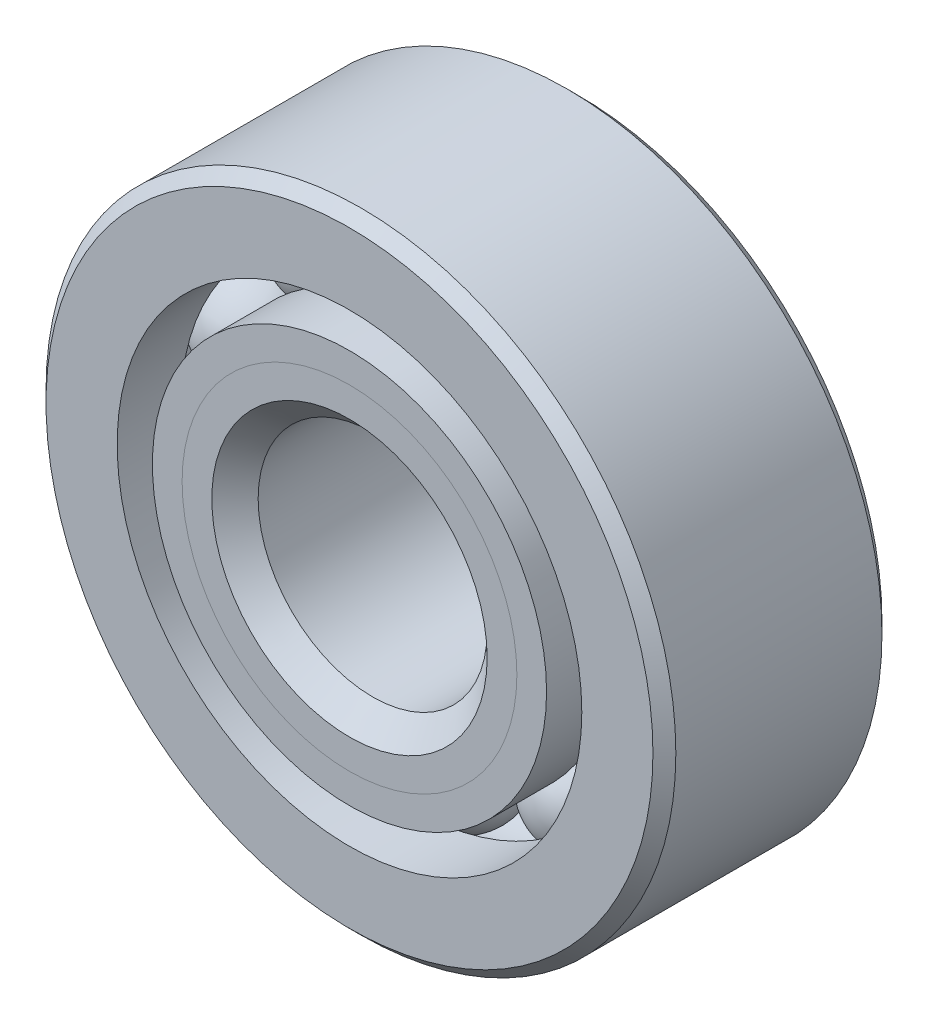
ISO-10303-21;
HEADER;
FILE_DESCRIPTION(('STEP AP214'),'2;1');
FILE_NAME('part.step','',(''),(''),'','','');
FILE_SCHEMA(('AUTOMOTIVE_DESIGN { 1 0 10303 214 1 1 1 1 }'));
ENDSEC;
DATA;
#1=APPLICATION_CONTEXT('core data for automotive mechanical design processes');
#2=APPLICATION_PROTOCOL_DEFINITION('international standard','automotive_design',2000,#1);
#3=PRODUCT_CONTEXT('',#1,'mechanical');
#4=PRODUCT('Part','Part','',(#3));
#5=PRODUCT_RELATED_PRODUCT_CATEGORY('part','',(#4));
#6=PRODUCT_DEFINITION_FORMATION('','',#4);
#7=PRODUCT_DEFINITION_CONTEXT('part definition',#1,'design');
#8=PRODUCT_DEFINITION('design','',#6,#7);
#9=PRODUCT_DEFINITION_SHAPE('','',#8);
#10=(LENGTH_UNIT() NAMED_UNIT(*) SI_UNIT(.MILLI.,.METRE.));
#11=(NAMED_UNIT(*) PLANE_ANGLE_UNIT() SI_UNIT($,.RADIAN.));
#12=(NAMED_UNIT(*) SI_UNIT($,.STERADIAN.) SOLID_ANGLE_UNIT());
#13=UNCERTAINTY_MEASURE_WITH_UNIT(LENGTH_MEASURE(1.E-05),#10,'distance_accuracy_value','');
#14=(GEOMETRIC_REPRESENTATION_CONTEXT(3) GLOBAL_UNCERTAINTY_ASSIGNED_CONTEXT((#13)) GLOBAL_UNIT_ASSIGNED_CONTEXT((#10,
#11,#12)) REPRESENTATION_CONTEXT('',''));
#15=CARTESIAN_POINT('',(0.,0.,0.));
#16=DIRECTION('',(0.,0.,1.));
#17=DIRECTION('',(1.,0.,0.));
#18=AXIS2_PLACEMENT_3D('',#15,#16,#17);
#19=CARTESIAN_POINT('',(-3.49915908005357,4.81617929463841,0.));
#20=DIRECTION('',(0.,0.,1.));
#21=DIRECTION('',(-0.587785252292462,0.809016994374955,0.));
#22=AXIS2_PLACEMENT_3D('',#19,#20,#21);
#23=SPHERICAL_SURFACE('',#22,1.4932612773582);
#24=CARTESIAN_POINT('',(-3.49915908005357,4.81617929463841,1.4932612773582));
#25=VERTEX_POINT('',#24);
#26=VERTEX_LOOP('',#25);
#27=FACE_BOUND('',#26,.T.);
#28=ADVANCED_FACE('F43',(#27),#23,.T.);
#29=CLOSED_SHELL('',(#28));
#30=MANIFOLD_SOLID_BREP('B2',#29);
#31=CARTESIAN_POINT('',(-5.66175832356957,1.83961679463842,0.));
#32=DIRECTION('',(0.,0.,1.));
#33=DIRECTION('',(-0.95105651629515,0.309016994374958,0.));
#34=AXIS2_PLACEMENT_3D('',#31,#32,#33);
#35=SPHERICAL_SURFACE('',#34,1.4932612773582);
#36=CARTESIAN_POINT('',(-5.66175832356957,1.83961679463842,1.4932612773582));
#37=VERTEX_POINT('',#36);
#38=VERTEX_LOOP('',#37);
#39=FACE_BOUND('',#38,.T.);
#40=ADVANCED_FACE('F64',(#39),#35,.T.);
#41=CLOSED_SHELL('',(#40));
#42=MANIFOLD_SOLID_BREP('B6',#41);
#43=CARTESIAN_POINT('',(-5.6617583235696,-1.8396167946383,0.));
#44=DIRECTION('',(0.,0.,1.));
#45=DIRECTION('',(-0.951056516295157,-0.309016994374938,0.));
#46=AXIS2_PLACEMENT_3D('',#43,#44,#45);
#47=SPHERICAL_SURFACE('',#46,1.4932612773582);
#48=CARTESIAN_POINT('',(-5.6617583235696,-1.8396167946383,1.4932612773582));
#49=VERTEX_POINT('',#48);
#50=VERTEX_LOOP('',#49);
#51=FACE_BOUND('',#50,.T.);
#52=ADVANCED_FACE('F85',(#51),#47,.T.);
#53=CLOSED_SHELL('',(#52));
#54=MANIFOLD_SOLID_BREP('B39',#53);
#55=CARTESIAN_POINT('',(-3.49915908005367,-4.81617929463833,0.));
#56=DIRECTION('',(0.,0.,1.));
#57=DIRECTION('',(-0.58778525229248,-0.809016994374942,0.));
#58=AXIS2_PLACEMENT_3D('',#55,#56,#57);
#59=SPHERICAL_SURFACE('',#58,1.4932612773582);
#60=CARTESIAN_POINT('',(-3.49915908005367,-4.81617929463833,1.4932612773582));
#61=VERTEX_POINT('',#60);
#62=VERTEX_LOOP('',#61);
#63=FACE_BOUND('',#62,.T.);
#64=ADVANCED_FACE('F106',(#63),#59,.T.);
#65=CLOSED_SHELL('',(#64));
#66=MANIFOLD_SOLID_BREP('B60',#65);
#67=CARTESIAN_POINT('',(0.,-5.953125,0.));
#68=DIRECTION('',(0.,0.,1.));
#69=DIRECTION('',(0.,-1.,0.));
#70=AXIS2_PLACEMENT_3D('',#67,#68,#69);
#71=SPHERICAL_SURFACE('',#70,1.4932612773582);
#72=CARTESIAN_POINT('',(0.,-5.953125,1.4932612773582));
#73=VERTEX_POINT('',#72);
#74=VERTEX_LOOP('',#73);
#75=FACE_BOUND('',#74,.T.);
#76=ADVANCED_FACE('F127',(#75),#71,.T.);
#77=CLOSED_SHELL('',(#76));
#78=MANIFOLD_SOLID_BREP('B81',#77);
#79=CARTESIAN_POINT('',(3.4991590800536,-4.81617929463838,0.));
#80=DIRECTION('',(0.,0.,1.));
#81=DIRECTION('',(0.587785252292469,-0.809016994374951,0.));
#82=AXIS2_PLACEMENT_3D('',#79,#80,#81);
#83=SPHERICAL_SURFACE('',#82,1.4932612773582);
#84=CARTESIAN_POINT('',(3.4991590800536,-4.81617929463838,1.4932612773582));
#85=VERTEX_POINT('',#84);
#86=VERTEX_LOOP('',#85);
#87=FACE_BOUND('',#86,.T.);
#88=ADVANCED_FACE('F148',(#87),#83,.T.);
#89=CLOSED_SHELL('',(#88));
#90=MANIFOLD_SOLID_BREP('B102',#89);
#91=CARTESIAN_POINT('',(5.66175832356958,-1.83961679463838,0.));
#92=DIRECTION('',(0.,0.,1.));
#93=DIRECTION('',(0.951056516295152,-0.309016994374952,0.));
#94=AXIS2_PLACEMENT_3D('',#91,#92,#93);
#95=SPHERICAL_SURFACE('',#94,1.4932612773582);
#96=CARTESIAN_POINT('',(5.66175832356958,-1.83961679463838,1.4932612773582));
#97=VERTEX_POINT('',#96);
#98=VERTEX_LOOP('',#97);
#99=FACE_BOUND('',#98,.T.);
#100=ADVANCED_FACE('F169',(#99),#95,.T.);
#101=CLOSED_SHELL('',(#100));
#102=MANIFOLD_SOLID_BREP('B123',#101);
#103=CARTESIAN_POINT('',(5.66175832356959,1.83961679463834,0.));
#104=DIRECTION('',(0.,0.,1.));
#105=DIRECTION('',(0.951056516295155,0.309016994374945,0.));
#106=AXIS2_PLACEMENT_3D('',#103,#104,#105);
#107=SPHERICAL_SURFACE('',#106,1.4932612773582);
#108=CARTESIAN_POINT('',(5.66175832356959,1.83961679463834,1.4932612773582));
#109=VERTEX_POINT('',#108);
#110=VERTEX_LOOP('',#109);
#111=FACE_BOUND('',#110,.T.);
#112=ADVANCED_FACE('F190',(#111),#107,.T.);
#113=CLOSED_SHELL('',(#112));
#114=MANIFOLD_SOLID_BREP('B144',#113);
#115=CARTESIAN_POINT('',(3.49915908005364,4.81617929463835,0.));
#116=DIRECTION('',(0.,0.,1.));
#117=DIRECTION('',(0.587785252292474,0.809016994374947,0.));
#118=AXIS2_PLACEMENT_3D('',#115,#116,#117);
#119=SPHERICAL_SURFACE('',#118,1.4932612773582);
#120=CARTESIAN_POINT('',(3.49915908005364,4.81617929463835,1.4932612773582));
#121=VERTEX_POINT('',#120);
#122=VERTEX_LOOP('',#121);
#123=FACE_BOUND('',#122,.T.);
#124=ADVANCED_FACE('F211',(#123),#119,.T.);
#125=CLOSED_SHELL('',(#124));
#126=MANIFOLD_SOLID_BREP('B165',#125);
#127=CARTESIAN_POINT('',(0.,5.953125,0.));
#128=DIRECTION('',(0.,0.,1.));
#129=DIRECTION('',(0.,1.,0.));
#130=AXIS2_PLACEMENT_3D('',#127,#128,#129);
#131=SPHERICAL_SURFACE('',#130,1.4932612773582);
#132=CARTESIAN_POINT('',(0.,5.953125,1.4932612773582));
#133=VERTEX_POINT('',#132);
#134=VERTEX_LOOP('',#133);
#135=FACE_BOUND('',#134,.T.);
#136=ADVANCED_FACE('F233',(#135),#131,.T.);
#137=CLOSED_SHELL('',(#136));
#138=MANIFOLD_SOLID_BREP('B186',#137);
#139=CARTESIAN_POINT('',(0.,4.64104766142968,3.175));
#140=DIRECTION('',(0.,0.,-1.));
#141=DIRECTION('',(-1.,0.,0.));
#142=AXIS2_PLACEMENT_3D('',#139,#140,#141);
#143=PLANE('',#142);
#144=CARTESIAN_POINT('',(0.,0.,3.175));
#145=DIRECTION('',(0.,0.,1.));
#146=DIRECTION('',(1.,0.,0.));
#147=AXIS2_PLACEMENT_3D('',#144,#145,#146);
#148=CIRCLE('',#147,3.8174318613209);
#149=CARTESIAN_POINT('',(3.8174318613209,0.,3.175));
#150=VERTEX_POINT('',#149);
#151=EDGE_CURVE('E288',#150,#150,#148,.T.);
#152=ORIENTED_EDGE('',*,*,#151,.F.);
#153=EDGE_LOOP('',(#152));
#154=FACE_BOUND('',#153,.T.);
#155=CARTESIAN_POINT('',(0.,0.,3.175));
#156=DIRECTION('',(0.,0.,1.));
#157=DIRECTION('',(1.,0.,0.));
#158=AXIS2_PLACEMENT_3D('',#155,#156,#157);
#159=CIRCLE('',#158,4.64104766142968);
#160=CARTESIAN_POINT('',(4.64104766142968,0.,3.175));
#161=VERTEX_POINT('',#160);
#162=EDGE_CURVE('E232',#161,#161,#159,.T.);
#163=ORIENTED_EDGE('',*,*,#162,.T.);
#164=EDGE_LOOP('',(#163));
#165=FACE_BOUND('',#164,.T.);
#166=ADVANCED_FACE('F254',(#154,#165),#143,.F.);
#167=CARTESIAN_POINT('',(0.,0.,2.35138419989122));
#168=DIRECTION('',(0.,0.,1.));
#169=DIRECTION('',(1.,0.,0.));
#170=AXIS2_PLACEMENT_3D('',#167,#168,#169);
#171=CONICAL_SURFACE('',#170,3.8174318613209,0.785398163397452);
#172=ORIENTED_EDGE('',*,*,#162,.F.);
#173=EDGE_LOOP('',(#172));
#174=FACE_BOUND('',#173,.T.);
#175=CARTESIAN_POINT('',(0.,0.,2.35138419989122));
#176=DIRECTION('',(0.,0.,1.));
#177=DIRECTION('',(1.,0.,0.));
#178=AXIS2_PLACEMENT_3D('',#175,#176,#177);
#179=CIRCLE('',#178,3.8174318613209);
#180=CARTESIAN_POINT('',(3.8174318613209,0.,2.35138419989122));
#181=VERTEX_POINT('',#180);
#182=EDGE_CURVE('E260',#181,#181,#179,.T.);
#183=ORIENTED_EDGE('',*,*,#182,.T.);
#184=EDGE_LOOP('',(#183));
#185=FACE_BOUND('',#184,.T.);
#186=ADVANCED_FACE('F295',(#174,#185),#171,.T.);
#187=CARTESIAN_POINT('',(0.,0.,3.175));
#188=DIRECTION('',(0.,0.,1.));
#189=DIRECTION('',(1.,0.,0.));
#190=AXIS2_PLACEMENT_3D('',#187,#188,#189);
#191=CYLINDRICAL_SURFACE('',#190,3.8174318613209);
#192=ORIENTED_EDGE('',*,*,#182,.F.);
#193=EDGE_LOOP('',(#192));
#194=FACE_BOUND('',#193,.T.);
#195=CARTESIAN_POINT('',(0.,0.,0.));
#196=DIRECTION('',(0.,0.,1.));
#197=DIRECTION('',(1.,0.,0.));
#198=AXIS2_PLACEMENT_3D('',#195,#196,#197);
#199=CIRCLE('',#198,3.8174318613209);
#200=CARTESIAN_POINT('',(3.8174318613209,0.,0.));
#201=VERTEX_POINT('',#200);
#202=EDGE_CURVE('E264',#201,#201,#199,.T.);
#203=ORIENTED_EDGE('',*,*,#202,.T.);
#204=EDGE_LOOP('',(#203));
#205=FACE_BOUND('',#204,.T.);
#206=ADVANCED_FACE('F299',(#194,#205),#191,.T.);
#207=CARTESIAN_POINT('',(0.,3.8174318613209,0.));
#208=DIRECTION('',(0.,0.,-1.));
#209=DIRECTION('',(-1.,0.,0.));
#210=AXIS2_PLACEMENT_3D('',#207,#208,#209);
#211=PLANE('',#210);
#212=ORIENTED_EDGE('',*,*,#202,.F.);
#213=EDGE_LOOP('',(#212));
#214=FACE_BOUND('',#213,.T.);
#215=CARTESIAN_POINT('',(0.,0.,0.));
#216=DIRECTION('',(0.,0.,1.));
#217=DIRECTION('',(1.,0.,0.));
#218=AXIS2_PLACEMENT_3D('',#215,#216,#217);
#219=CIRCLE('',#218,4.4598637226418);
#220=CARTESIAN_POINT('',(4.4598637226418,0.,0.));
#221=VERTEX_POINT('',#220);
#222=EDGE_CURVE('E268',#221,#221,#219,.T.);
#223=ORIENTED_EDGE('',*,*,#222,.T.);
#224=EDGE_LOOP('',(#223));
#225=FACE_BOUND('',#224,.T.);
#226=ADVANCED_FACE('F304',(#214,#225),#211,.F.);
#227=CARTESIAN_POINT('',(0.,0.,0.));
#228=DIRECTION('',(0.,0.,1.));
#229=DIRECTION('',(1.,0.,0.));
#230=AXIS2_PLACEMENT_3D('',#227,#228,#229);
#231=TOROIDAL_SURFACE('',#230,5.953125,1.4932612773582);
#232=ORIENTED_EDGE('',*,*,#222,.F.);
#233=EDGE_LOOP('',(#232));
#234=FACE_BOUND('',#233,.T.);
#235=CARTESIAN_POINT('',(0.,0.,-1.41111111111111));
#236=DIRECTION('',(0.,0.,1.));
#237=DIRECTION('',(1.,0.,0.));
#238=AXIS2_PLACEMENT_3D('',#235,#236,#237);
#239=CIRCLE('',#238,5.46466346153846);
#240=CARTESIAN_POINT('',(5.46466346153846,0.,-1.41111111111111));
#241=VERTEX_POINT('',#240);
#242=EDGE_CURVE('E273',#241,#241,#239,.T.);
#243=ORIENTED_EDGE('',*,*,#242,.T.);
#244=EDGE_LOOP('',(#243));
#245=FACE_BOUND('',#244,.T.);
#246=ADVANCED_FACE('F310',(#234,#245),#231,.F.);
#247=CARTESIAN_POINT('',(0.,0.,3.175));
#248=DIRECTION('',(0.,0.,1.));
#249=DIRECTION('',(1.,0.,0.));
#250=AXIS2_PLACEMENT_3D('',#247,#248,#249);
#251=CYLINDRICAL_SURFACE('',#250,5.46466346153846);
#252=ORIENTED_EDGE('',*,*,#242,.F.);
#253=EDGE_LOOP('',(#252));
#254=FACE_BOUND('',#253,.T.);
#255=CARTESIAN_POINT('',(0.,0.,-3.17500000000001));
#256=DIRECTION('',(0.,0.,1.));
#257=DIRECTION('',(1.,0.,0.));
#258=AXIS2_PLACEMENT_3D('',#255,#256,#257);
#259=CIRCLE('',#258,5.46466346153846);
#260=CARTESIAN_POINT('',(5.46466346153846,0.,-3.17500000000001));
#261=VERTEX_POINT('',#260);
#262=EDGE_CURVE('E276',#261,#261,#259,.T.);
#263=ORIENTED_EDGE('',*,*,#262,.T.);
#264=EDGE_LOOP('',(#263));
#265=FACE_BOUND('',#264,.T.);
#266=ADVANCED_FACE('F314',(#254,#265),#251,.T.);
#267=CARTESIAN_POINT('',(0.,3.4925,-3.17500000000001));
#268=DIRECTION('',(0.,0.,1.));
#269=DIRECTION('',(1.,0.,0.));
#270=AXIS2_PLACEMENT_3D('',#267,#268,#269);
#271=PLANE('',#270);
#272=ORIENTED_EDGE('',*,*,#262,.F.);
#273=EDGE_LOOP('',(#272));
#274=FACE_BOUND('',#273,.T.);
#275=CARTESIAN_POINT('',(0.,0.,-3.17500000000001));
#276=DIRECTION('',(0.,0.,1.));
#277=DIRECTION('',(1.,0.,0.));
#278=AXIS2_PLACEMENT_3D('',#275,#276,#277);
#279=CIRCLE('',#278,3.4925);
#280=CARTESIAN_POINT('',(3.4925,0.,-3.17500000000001));
#281=VERTEX_POINT('',#280);
#282=EDGE_CURVE('E279',#281,#281,#279,.T.);
#283=ORIENTED_EDGE('',*,*,#282,.T.);
#284=EDGE_LOOP('',(#283));
#285=FACE_BOUND('',#284,.T.);
#286=ADVANCED_FACE('F318',(#274,#285),#271,.F.);
#287=CARTESIAN_POINT('',(0.,0.,-2.8575));
#288=DIRECTION('',(0.,0.,-1.));
#289=DIRECTION('',(-1.,0.,0.));
#290=AXIS2_PLACEMENT_3D('',#287,#288,#289);
#291=CONICAL_SURFACE('',#290,3.175,0.785398163397446);
#292=ORIENTED_EDGE('',*,*,#282,.F.);
#293=EDGE_LOOP('',(#292));
#294=FACE_BOUND('',#293,.T.);
#295=CARTESIAN_POINT('',(0.,0.,-2.8575));
#296=DIRECTION('',(0.,0.,1.));
#297=DIRECTION('',(1.,0.,0.));
#298=AXIS2_PLACEMENT_3D('',#295,#296,#297);
#299=CIRCLE('',#298,3.175);
#300=CARTESIAN_POINT('',(3.175,0.,-2.8575));
#301=VERTEX_POINT('',#300);
#302=EDGE_CURVE('E282',#301,#301,#299,.T.);
#303=ORIENTED_EDGE('',*,*,#302,.T.);
#304=EDGE_LOOP('',(#303));
#305=FACE_BOUND('',#304,.T.);
#306=ADVANCED_FACE('F322',(#294,#305),#291,.F.);
#307=CARTESIAN_POINT('',(0.,0.,3.175));
#308=DIRECTION('',(0.,0.,1.));
#309=DIRECTION('',(1.,0.,0.));
#310=AXIS2_PLACEMENT_3D('',#307,#308,#309);
#311=CYLINDRICAL_SURFACE('',#310,3.175);
#312=ORIENTED_EDGE('',*,*,#302,.F.);
#313=EDGE_LOOP('',(#312));
#314=FACE_BOUND('',#313,.T.);
#315=CARTESIAN_POINT('',(0.,0.,2.53256813867911));
#316=DIRECTION('',(0.,0.,1.));
#317=DIRECTION('',(1.,0.,0.));
#318=AXIS2_PLACEMENT_3D('',#315,#316,#317);
#319=CIRCLE('',#318,3.175);
#320=CARTESIAN_POINT('',(3.175,0.,2.53256813867911));
#321=VERTEX_POINT('',#320);
#322=EDGE_CURVE('E285',#321,#321,#319,.T.);
#323=ORIENTED_EDGE('',*,*,#322,.T.);
#324=EDGE_LOOP('',(#323));
#325=FACE_BOUND('',#324,.T.);
#326=ADVANCED_FACE('F326',(#314,#325),#311,.F.);
#327=CARTESIAN_POINT('',(0.,0.,3.175));
#328=DIRECTION('',(0.,0.,1.));
#329=DIRECTION('',(1.,0.,0.));
#330=AXIS2_PLACEMENT_3D('',#327,#328,#329);
#331=CONICAL_SURFACE('',#330,3.8174318613209,0.785398163397451);
#332=ORIENTED_EDGE('',*,*,#322,.F.);
#333=EDGE_LOOP('',(#332));
#334=FACE_BOUND('',#333,.T.);
#335=ORIENTED_EDGE('',*,*,#151,.T.);
#336=EDGE_LOOP('',(#335));
#337=FACE_BOUND('',#336,.T.);
#338=ADVANCED_FACE('F292',(#334,#337),#331,.F.);
#339=CLOSED_SHELL('',(#166,#186,#206,#226,#246,#266,#286,#306,#326,#338));
#340=MANIFOLD_SOLID_BREP('B207',#339);
#341=CARTESIAN_POINT('',(0.,5.46466346153846,3.175));
#342=DIRECTION('',(0.,0.,-1.));
#343=DIRECTION('',(-1.,0.,0.));
#344=AXIS2_PLACEMENT_3D('',#341,#342,#343);
#345=PLANE('',#344);
#346=CARTESIAN_POINT('',(0.,0.,3.175));
#347=DIRECTION('',(0.,0.,1.));
#348=DIRECTION('',(1.,0.,0.));
#349=AXIS2_PLACEMENT_3D('',#346,#347,#348);
#350=CIRCLE('',#349,4.64104766142968);
#351=CARTESIAN_POINT('',(4.64104766142968,0.,3.175));
#352=VERTEX_POINT('',#351);
#353=EDGE_CURVE('E253',#352,#352,#350,.T.);
#354=ORIENTED_EDGE('',*,*,#353,.F.);
#355=EDGE_LOOP('',(#354));
#356=FACE_BOUND('',#355,.T.);
#357=CARTESIAN_POINT('',(0.,0.,3.175));
#358=DIRECTION('',(0.,0.,1.));
#359=DIRECTION('',(1.,0.,0.));
#360=AXIS2_PLACEMENT_3D('',#357,#358,#359);
#361=CIRCLE('',#360,5.46466346153846);
#362=CARTESIAN_POINT('',(5.46466346153846,0.,3.175));
#363=VERTEX_POINT('',#362);
#364=EDGE_CURVE('E435',#363,#363,#361,.T.);
#365=ORIENTED_EDGE('',*,*,#364,.T.);
#366=EDGE_LOOP('',(#365));
#367=FACE_BOUND('',#366,.T.);
#368=ADVANCED_FACE('F413',(#356,#367),#345,.F.);
#369=CARTESIAN_POINT('',(0.,0.,3.175));
#370=DIRECTION('',(0.,0.,1.));
#371=DIRECTION('',(1.,0.,0.));
#372=AXIS2_PLACEMENT_3D('',#369,#370,#371);
#373=CONICAL_SURFACE('',#372,4.64104766142968,0.785398163397452);
#374=CARTESIAN_POINT('',(0.,0.,2.35138419989122));
#375=DIRECTION('',(0.,0.,1.));
#376=DIRECTION('',(1.,0.,0.));
#377=AXIS2_PLACEMENT_3D('',#374,#375,#376);
#378=CIRCLE('',#377,3.8174318613209);
#379=CARTESIAN_POINT('',(3.8174318613209,0.,2.35138419989122));
#380=VERTEX_POINT('',#379);
#381=EDGE_CURVE('E419',#380,#380,#378,.T.);
#382=ORIENTED_EDGE('',*,*,#381,.F.);
#383=EDGE_LOOP('',(#382));
#384=FACE_BOUND('',#383,.T.);
#385=ORIENTED_EDGE('',*,*,#353,.T.);
#386=EDGE_LOOP('',(#385));
#387=FACE_BOUND('',#386,.T.);
#388=ADVANCED_FACE('F460',(#384,#387),#373,.F.);
#389=CARTESIAN_POINT('',(0.,0.,3.175));
#390=DIRECTION('',(0.,0.,1.));
#391=DIRECTION('',(1.,0.,0.));
#392=AXIS2_PLACEMENT_3D('',#389,#390,#391);
#393=CYLINDRICAL_SURFACE('',#392,3.8174318613209);
#394=CARTESIAN_POINT('',(0.,0.,0.));
#395=DIRECTION('',(0.,0.,1.));
#396=DIRECTION('',(1.,0.,0.));
#397=AXIS2_PLACEMENT_3D('',#394,#395,#396);
#398=CIRCLE('',#397,3.8174318613209);
#399=CARTESIAN_POINT('',(3.8174318613209,0.,0.));
#400=VERTEX_POINT('',#399);
#401=EDGE_CURVE('E423',#400,#400,#398,.T.);
#402=ORIENTED_EDGE('',*,*,#401,.F.);
#403=EDGE_LOOP('',(#402));
#404=FACE_BOUND('',#403,.T.);
#405=ORIENTED_EDGE('',*,*,#381,.T.);
#406=EDGE_LOOP('',(#405));
#407=FACE_BOUND('',#406,.T.);
#408=ADVANCED_FACE('F455',(#404,#407),#393,.F.);
#409=CARTESIAN_POINT('',(0.,3.8174318613209,0.));
#410=DIRECTION('',(0.,0.,1.));
#411=DIRECTION('',(1.,0.,0.));
#412=AXIS2_PLACEMENT_3D('',#409,#410,#411);
#413=PLANE('',#412);
#414=CARTESIAN_POINT('',(0.,0.,0.));
#415=DIRECTION('',(0.,0.,1.));
#416=DIRECTION('',(1.,0.,0.));
#417=AXIS2_PLACEMENT_3D('',#414,#415,#416);
#418=CIRCLE('',#417,4.4598637226418);
#419=CARTESIAN_POINT('',(4.4598637226418,0.,0.));
#420=VERTEX_POINT('',#419);
#421=EDGE_CURVE('E427',#420,#420,#418,.T.);
#422=ORIENTED_EDGE('',*,*,#421,.F.);
#423=EDGE_LOOP('',(#422));
#424=FACE_BOUND('',#423,.T.);
#425=ORIENTED_EDGE('',*,*,#401,.T.);
#426=EDGE_LOOP('',(#425));
#427=FACE_BOUND('',#426,.T.);
#428=ADVANCED_FACE('F449',(#424,#427),#413,.F.);
#429=CARTESIAN_POINT('',(0.,0.,0.));
#430=DIRECTION('',(0.,0.,1.));
#431=DIRECTION('',(1.,0.,0.));
#432=AXIS2_PLACEMENT_3D('',#429,#430,#431);
#433=TOROIDAL_SURFACE('',#432,5.953125,1.4932612773582);
#434=CARTESIAN_POINT('',(0.,0.,1.41111111111111));
#435=DIRECTION('',(0.,0.,1.));
#436=DIRECTION('',(1.,0.,0.));
#437=AXIS2_PLACEMENT_3D('',#434,#435,#436);
#438=CIRCLE('',#437,5.46466346153846);
#439=CARTESIAN_POINT('',(5.46466346153846,0.,1.41111111111111));
#440=VERTEX_POINT('',#439);
#441=EDGE_CURVE('E432',#440,#440,#438,.T.);
#442=ORIENTED_EDGE('',*,*,#441,.F.);
#443=EDGE_LOOP('',(#442));
#444=FACE_BOUND('',#443,.T.);
#445=ORIENTED_EDGE('',*,*,#421,.T.);
#446=EDGE_LOOP('',(#445));
#447=FACE_BOUND('',#446,.T.);
#448=ADVANCED_FACE('F443',(#444,#447),#433,.F.);
#449=CARTESIAN_POINT('',(0.,0.,3.175));
#450=DIRECTION('',(0.,0.,1.));
#451=DIRECTION('',(1.,0.,0.));
#452=AXIS2_PLACEMENT_3D('',#449,#450,#451);
#453=CYLINDRICAL_SURFACE('',#452,5.46466346153846);
#454=ORIENTED_EDGE('',*,*,#364,.F.);
#455=EDGE_LOOP('',(#454));
#456=FACE_BOUND('',#455,.T.);
#457=ORIENTED_EDGE('',*,*,#441,.T.);
#458=EDGE_LOOP('',(#457));
#459=FACE_BOUND('',#458,.T.);
#460=ADVANCED_FACE('F440',(#456,#459),#453,.T.);
#461=CLOSED_SHELL('',(#368,#388,#408,#428,#448,#460));
#462=MANIFOLD_SOLID_BREP('B227',#461);
#463=CARTESIAN_POINT('',(0.,0.,2.8575));
#464=DIRECTION('',(0.,0.,-1.));
#465=DIRECTION('',(-1.,0.,0.));
#466=AXIS2_PLACEMENT_3D('',#463,#464,#465);
#467=CONICAL_SURFACE('',#466,8.73125,0.785398163397452);
#468=CARTESIAN_POINT('',(0.,0.,3.175));
#469=DIRECTION('',(0.,0.,1.));
#470=DIRECTION('',(1.,0.,0.));
#471=AXIS2_PLACEMENT_3D('',#468,#469,#470);
#472=CIRCLE('',#471,8.41375);
#473=CARTESIAN_POINT('',(8.41375,0.,3.175));
#474=VERTEX_POINT('',#473);
#475=EDGE_CURVE('E533',#474,#474,#472,.T.);
#476=ORIENTED_EDGE('',*,*,#475,.F.);
#477=EDGE_LOOP('',(#476));
#478=FACE_BOUND('',#477,.T.);
#479=CARTESIAN_POINT('',(0.,0.,2.8575));
#480=DIRECTION('',(0.,0.,1.));
#481=DIRECTION('',(1.,0.,0.));
#482=AXIS2_PLACEMENT_3D('',#479,#480,#481);
#483=CIRCLE('',#482,8.73125);
#484=CARTESIAN_POINT('',(8.73125,0.,2.8575));
#485=VERTEX_POINT('',#484);
#486=EDGE_CURVE('E412',#485,#485,#483,.T.);
#487=ORIENTED_EDGE('',*,*,#486,.T.);
#488=EDGE_LOOP('',(#487));
#489=FACE_BOUND('',#488,.T.);
#490=ADVANCED_FACE('F505',(#478,#489),#467,.T.);
#491=CARTESIAN_POINT('',(0.,0.,3.175));
#492=DIRECTION('',(0.,0.,1.));
#493=DIRECTION('',(1.,0.,0.));
#494=AXIS2_PLACEMENT_3D('',#491,#492,#493);
#495=CYLINDRICAL_SURFACE('',#494,8.73125);
#496=ORIENTED_EDGE('',*,*,#486,.F.);
#497=EDGE_LOOP('',(#496));
#498=FACE_BOUND('',#497,.T.);
#499=CARTESIAN_POINT('',(0.,0.,-2.8575));
#500=DIRECTION('',(0.,0.,1.));
#501=DIRECTION('',(1.,0.,0.));
#502=AXIS2_PLACEMENT_3D('',#499,#500,#501);
#503=CIRCLE('',#502,8.73125);
#504=CARTESIAN_POINT('',(8.73125,0.,-2.8575));
#505=VERTEX_POINT('',#504);
#506=EDGE_CURVE('E511',#505,#505,#503,.T.);
#507=ORIENTED_EDGE('',*,*,#506,.T.);
#508=EDGE_LOOP('',(#507));
#509=FACE_BOUND('',#508,.T.);
#510=ADVANCED_FACE('F540',(#498,#509),#495,.T.);
#511=CARTESIAN_POINT('',(0.,0.,-3.17500000000001));
#512=DIRECTION('',(0.,0.,1.));
#513=DIRECTION('',(1.,0.,0.));
#514=AXIS2_PLACEMENT_3D('',#511,#512,#513);
#515=CONICAL_SURFACE('',#514,8.41375,0.785398163397451);
#516=ORIENTED_EDGE('',*,*,#506,.F.);
#517=EDGE_LOOP('',(#516));
#518=FACE_BOUND('',#517,.T.);
#519=CARTESIAN_POINT('',(0.,0.,-3.17500000000001));
#520=DIRECTION('',(0.,0.,1.));
#521=DIRECTION('',(1.,0.,0.));
#522=AXIS2_PLACEMENT_3D('',#519,#520,#521);
#523=CIRCLE('',#522,8.41375);
#524=CARTESIAN_POINT('',(8.41375,0.,-3.17500000000001));
#525=VERTEX_POINT('',#524);
#526=EDGE_CURVE('E515',#525,#525,#523,.T.);
#527=ORIENTED_EDGE('',*,*,#526,.T.);
#528=EDGE_LOOP('',(#527));
#529=FACE_BOUND('',#528,.T.);
#530=ADVANCED_FACE('F544',(#518,#529),#515,.T.);
#531=CARTESIAN_POINT('',(0.,8.41375,-3.17500000000001));
#532=DIRECTION('',(0.,0.,1.));
#533=DIRECTION('',(1.,0.,0.));
#534=AXIS2_PLACEMENT_3D('',#531,#532,#533);
#535=PLANE('',#534);
#536=ORIENTED_EDGE('',*,*,#526,.F.);
#537=EDGE_LOOP('',(#536));
#538=FACE_BOUND('',#537,.T.);
#539=CARTESIAN_POINT('',(0.,0.,-3.17500000000001));
#540=DIRECTION('',(0.,0.,1.));
#541=DIRECTION('',(1.,0.,0.));
#542=AXIS2_PLACEMENT_3D('',#539,#540,#541);
#543=CIRCLE('',#542,6.44158653846153);
#544=CARTESIAN_POINT('',(6.44158653846153,0.,-3.17500000000001));
#545=VERTEX_POINT('',#544);
#546=EDGE_CURVE('E519',#545,#545,#543,.T.);
#547=ORIENTED_EDGE('',*,*,#546,.T.);
#548=EDGE_LOOP('',(#547));
#549=FACE_BOUND('',#548,.T.);
#550=ADVANCED_FACE('F549',(#538,#549),#535,.F.);
#551=CARTESIAN_POINT('',(0.,0.,3.175));
#552=DIRECTION('',(0.,0.,1.));
#553=DIRECTION('',(1.,0.,0.));
#554=AXIS2_PLACEMENT_3D('',#551,#552,#553);
#555=CYLINDRICAL_SURFACE('',#554,6.44158653846154);
#556=ORIENTED_EDGE('',*,*,#546,.F.);
#557=EDGE_LOOP('',(#556));
#558=FACE_BOUND('',#557,.T.);
#559=CARTESIAN_POINT('',(0.,0.,-1.41111111111111));
#560=DIRECTION('',(0.,0.,1.));
#561=DIRECTION('',(1.,0.,0.));
#562=AXIS2_PLACEMENT_3D('',#559,#560,#561);
#563=CIRCLE('',#562,6.44158653846154);
#564=CARTESIAN_POINT('',(6.44158653846154,0.,-1.41111111111111));
#565=VERTEX_POINT('',#564);
#566=EDGE_CURVE('E524',#565,#565,#563,.T.);
#567=ORIENTED_EDGE('',*,*,#566,.T.);
#568=EDGE_LOOP('',(#567));
#569=FACE_BOUND('',#568,.T.);
#570=ADVANCED_FACE('F555',(#558,#569),#555,.F.);
#571=CARTESIAN_POINT('',(0.,0.,0.));
#572=DIRECTION('',(0.,0.,1.));
#573=DIRECTION('',(1.,0.,0.));
#574=AXIS2_PLACEMENT_3D('',#571,#572,#573);
#575=TOROIDAL_SURFACE('',#574,5.953125,1.4932612773582);
#576=ORIENTED_EDGE('',*,*,#566,.F.);
#577=EDGE_LOOP('',(#576));
#578=FACE_BOUND('',#577,.T.);
#579=CARTESIAN_POINT('',(0.,0.,1.41111111111111));
#580=DIRECTION('',(0.,0.,1.));
#581=DIRECTION('',(1.,0.,0.));
#582=AXIS2_PLACEMENT_3D('',#579,#580,#581);
#583=CIRCLE('',#582,6.44158653846154);
#584=CARTESIAN_POINT('',(6.44158653846154,0.,1.41111111111111));
#585=VERTEX_POINT('',#584);
#586=EDGE_CURVE('E527',#585,#585,#583,.T.);
#587=ORIENTED_EDGE('',*,*,#586,.T.);
#588=EDGE_LOOP('',(#587));
#589=FACE_BOUND('',#588,.T.);
#590=ADVANCED_FACE('F559',(#578,#589),#575,.F.);
#591=CARTESIAN_POINT('',(0.,0.,3.175));
#592=DIRECTION('',(0.,0.,1.));
#593=DIRECTION('',(1.,0.,0.));
#594=AXIS2_PLACEMENT_3D('',#591,#592,#593);
#595=CYLINDRICAL_SURFACE('',#594,6.44158653846154);
#596=ORIENTED_EDGE('',*,*,#586,.F.);
#597=EDGE_LOOP('',(#596));
#598=FACE_BOUND('',#597,.T.);
#599=CARTESIAN_POINT('',(0.,0.,3.175));
#600=DIRECTION('',(0.,0.,1.));
#601=DIRECTION('',(1.,0.,0.));
#602=AXIS2_PLACEMENT_3D('',#599,#600,#601);
#603=CIRCLE('',#602,6.44158653846153);
#604=CARTESIAN_POINT('',(6.44158653846153,0.,3.175));
#605=VERTEX_POINT('',#604);
#606=EDGE_CURVE('E530',#605,#605,#603,.T.);
#607=ORIENTED_EDGE('',*,*,#606,.T.);
#608=EDGE_LOOP('',(#607));
#609=FACE_BOUND('',#608,.T.);
#610=ADVANCED_FACE('F563',(#598,#609),#595,.F.);
#611=CARTESIAN_POINT('',(0.,8.41375,3.175));
#612=DIRECTION('',(0.,0.,-1.));
#613=DIRECTION('',(-1.,0.,0.));
#614=AXIS2_PLACEMENT_3D('',#611,#612,#613);
#615=PLANE('',#614);
#616=ORIENTED_EDGE('',*,*,#606,.F.);
#617=EDGE_LOOP('',(#616));
#618=FACE_BOUND('',#617,.T.);
#619=ORIENTED_EDGE('',*,*,#475,.T.);
#620=EDGE_LOOP('',(#619));
#621=FACE_BOUND('',#620,.T.);
#622=ADVANCED_FACE('F537',(#618,#621),#615,.F.);
#623=CLOSED_SHELL('',(#490,#510,#530,#550,#570,#590,#610,#622));
#624=MANIFOLD_SOLID_BREP('B248',#623);
#625=ADVANCED_BREP_SHAPE_REPRESENTATION('',(#18,#30,#42,#54,#66,#78,#90,#102,#114,#126,#138,
#340,#462,#624),#14);
#626=SHAPE_DEFINITION_REPRESENTATION(#9,#625);
ENDSEC;
END-ISO-10303-21;
